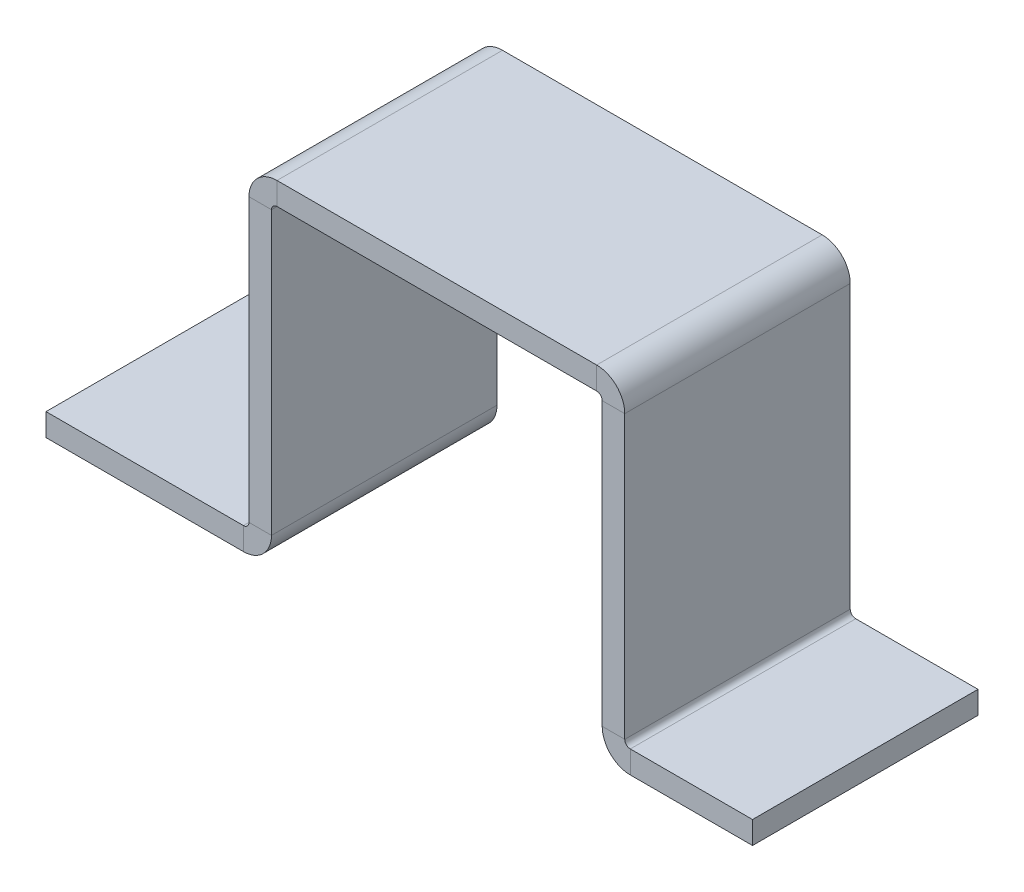
ISO-10303-21;
HEADER;
FILE_DESCRIPTION(('STEP AP214'),'2;1');
FILE_NAME('part.step','',(''),(''),'','','');
FILE_SCHEMA(('AUTOMOTIVE_DESIGN { 1 0 10303 214 1 1 1 1 }'));
ENDSEC;
DATA;
#1=APPLICATION_CONTEXT('core data for automotive mechanical design processes');
#2=APPLICATION_PROTOCOL_DEFINITION('international standard','automotive_design',2000,#1);
#3=PRODUCT_CONTEXT('',#1,'mechanical');
#4=PRODUCT('Part','Part','',(#3));
#5=PRODUCT_RELATED_PRODUCT_CATEGORY('part','',(#4));
#6=PRODUCT_DEFINITION_FORMATION('','',#4);
#7=PRODUCT_DEFINITION_CONTEXT('part definition',#1,'design');
#8=PRODUCT_DEFINITION('design','',#6,#7);
#9=PRODUCT_DEFINITION_SHAPE('','',#8);
#10=(LENGTH_UNIT() NAMED_UNIT(*) SI_UNIT(.MILLI.,.METRE.));
#11=(NAMED_UNIT(*) PLANE_ANGLE_UNIT() SI_UNIT($,.RADIAN.));
#12=(NAMED_UNIT(*) SI_UNIT($,.STERADIAN.) SOLID_ANGLE_UNIT());
#13=UNCERTAINTY_MEASURE_WITH_UNIT(LENGTH_MEASURE(1.E-05),#10,'distance_accuracy_value','');
#14=(GEOMETRIC_REPRESENTATION_CONTEXT(3) GLOBAL_UNCERTAINTY_ASSIGNED_CONTEXT((#13)) GLOBAL_UNIT_ASSIGNED_CONTEXT((#10,
#11,#12)) REPRESENTATION_CONTEXT('',''));
#15=CARTESIAN_POINT('',(0.,0.,0.));
#16=DIRECTION('',(0.,0.,1.));
#17=DIRECTION('',(1.,0.,0.));
#18=AXIS2_PLACEMENT_3D('',#15,#16,#17);
#19=CARTESIAN_POINT('',(27.,3.7366,30.));
#20=DIRECTION('',(0.,0.,1.));
#21=DIRECTION('',(1.,0.,0.));
#22=AXIS2_PLACEMENT_3D('',#19,#20,#21);
#23=PLANE('',#22);
#24=DIRECTION('',(1.,0.,0.));
#25=VECTOR('',#24,1.);
#26=CARTESIAN_POINT('',(27.,3.7366,30.));
#27=LINE('',#26,#25);
#28=CARTESIAN_POINT('',(27.,3.7366,30.));
#29=VERTEX_POINT('',#28);
#30=CARTESIAN_POINT('',(30.,3.7366,30.));
#31=VERTEX_POINT('',#30);
#32=EDGE_CURVE('E11',#29,#31,#27,.T.);
#33=ORIENTED_EDGE('',*,*,#32,.F.);
#34=CARTESIAN_POINT('',(26.2634,3.7366,30.));
#35=DIRECTION('',(0.,0.,-1.));
#36=DIRECTION('',(-1.,0.,0.));
#37=AXIS2_PLACEMENT_3D('',#34,#35,#36);
#38=CIRCLE('',#37,0.7366);
#39=CARTESIAN_POINT('',(26.2634,3.,30.));
#40=VERTEX_POINT('',#39);
#41=EDGE_CURVE('E368',#40,#29,#38,.F.);
#42=ORIENTED_EDGE('',*,*,#41,.F.);
#43=DIRECTION('',(0.,1.,0.));
#44=VECTOR('',#43,1.);
#45=CARTESIAN_POINT('',(26.2634,0.,30.));
#46=LINE('',#45,#44);
#47=CARTESIAN_POINT('',(26.2634,0.,30.));
#48=VERTEX_POINT('',#47);
#49=EDGE_CURVE('E47',#48,#40,#46,.T.);
#50=ORIENTED_EDGE('',*,*,#49,.F.);
#51=CARTESIAN_POINT('',(26.2634,3.7366,30.));
#52=DIRECTION('',(0.,0.,1.));
#53=DIRECTION('',(1.,0.,0.));
#54=AXIS2_PLACEMENT_3D('',#51,#52,#53);
#55=CIRCLE('',#54,3.7366);
#56=EDGE_CURVE('E381',#48,#31,#55,.T.);
#57=ORIENTED_EDGE('',*,*,#56,.T.);
#58=EDGE_LOOP('',(#33,#42,#50,#57));
#59=FACE_BOUND('',#58,.T.);
#60=ADVANCED_FACE('F39',(#59),#23,.T.);
#61=CARTESIAN_POINT('',(26.2634,0.,30.));
#62=DIRECTION('',(0.,0.,1.));
#63=DIRECTION('',(1.,0.,0.));
#64=AXIS2_PLACEMENT_3D('',#61,#62,#63);
#65=PLANE('',#64);
#66=DIRECTION('',(0.,1.,0.));
#67=VECTOR('',#66,1.);
#68=CARTESIAN_POINT('',(27.,3.,30.));
#69=LINE('',#68,#67);
#70=CARTESIAN_POINT('',(27.,41.2634,30.));
#71=VERTEX_POINT('',#70);
#72=EDGE_CURVE('E372',#29,#71,#69,.T.);
#73=ORIENTED_EDGE('',*,*,#72,.F.);
#74=ORIENTED_EDGE('',*,*,#32,.T.);
#75=DIRECTION('',(0.,1.,0.));
#76=VECTOR('',#75,1.);
#77=CARTESIAN_POINT('',(30.,3.,30.));
#78=LINE('',#77,#76);
#79=CARTESIAN_POINT('',(30.,41.2634,30.));
#80=VERTEX_POINT('',#79);
#81=EDGE_CURVE('E383',#31,#80,#78,.T.);
#82=ORIENTED_EDGE('',*,*,#81,.T.);
#83=DIRECTION('',(-1.,0.,0.));
#84=VECTOR('',#83,1.);
#85=CARTESIAN_POINT('',(30.,41.2634,30.));
#86=LINE('',#85,#84);
#87=EDGE_CURVE('E342',#80,#71,#86,.T.);
#88=ORIENTED_EDGE('',*,*,#87,.T.);
#89=EDGE_LOOP('',(#73,#74,#82,#88));
#90=FACE_BOUND('',#89,.T.);
#91=ADVANCED_FACE('F452',(#90),#65,.T.);
#92=CARTESIAN_POINT('',(26.2634,3.,0.));
#93=DIRECTION('',(0.,0.,-1.));
#94=DIRECTION('',(-1.,0.,0.));
#95=AXIS2_PLACEMENT_3D('',#92,#93,#94);
#96=PLANE('',#95);
#97=DIRECTION('',(0.,-1.,0.));
#98=VECTOR('',#97,1.);
#99=CARTESIAN_POINT('',(26.2634,3.,0.));
#100=LINE('',#99,#98);
#101=CARTESIAN_POINT('',(26.2634,3.,0.));
#102=VERTEX_POINT('',#101);
#103=CARTESIAN_POINT('',(26.2634,0.,0.));
#104=VERTEX_POINT('',#103);
#105=EDGE_CURVE('E348',#102,#104,#100,.T.);
#106=ORIENTED_EDGE('',*,*,#105,.F.);
#107=CARTESIAN_POINT('',(26.2634,3.7366,0.));
#108=DIRECTION('',(0.,0.,-1.));
#109=DIRECTION('',(-1.,0.,0.));
#110=AXIS2_PLACEMENT_3D('',#107,#108,#109);
#111=CIRCLE('',#110,0.7366);
#112=CARTESIAN_POINT('',(27.,3.7366,0.));
#113=VERTEX_POINT('',#112);
#114=EDGE_CURVE('E252',#102,#113,#111,.F.);
#115=ORIENTED_EDGE('',*,*,#114,.T.);
#116=DIRECTION('',(-1.,0.,0.));
#117=VECTOR('',#116,1.);
#118=CARTESIAN_POINT('',(30.,3.7366,0.));
#119=LINE('',#118,#117);
#120=CARTESIAN_POINT('',(30.,3.7366,0.));
#121=VERTEX_POINT('',#120);
#122=EDGE_CURVE('E346',#121,#113,#119,.T.);
#123=ORIENTED_EDGE('',*,*,#122,.F.);
#124=CARTESIAN_POINT('',(26.2634,3.7366,0.));
#125=DIRECTION('',(0.,0.,1.));
#126=DIRECTION('',(1.,0.,0.));
#127=AXIS2_PLACEMENT_3D('',#124,#125,#126);
#128=CIRCLE('',#127,3.7366);
#129=EDGE_CURVE('E264',#104,#121,#128,.T.);
#130=ORIENTED_EDGE('',*,*,#129,.F.);
#131=EDGE_LOOP('',(#106,#115,#123,#130));
#132=FACE_BOUND('',#131,.T.);
#133=ADVANCED_FACE('F494',(#132),#96,.T.);
#134=CARTESIAN_POINT('',(30.,3.7366,0.));
#135=DIRECTION('',(0.,0.,-1.));
#136=DIRECTION('',(-1.,0.,0.));
#137=AXIS2_PLACEMENT_3D('',#134,#135,#136);
#138=PLANE('',#137);
#139=DIRECTION('',(1.,0.,0.));
#140=VECTOR('',#139,1.);
#141=CARTESIAN_POINT('',(0.,3.,0.));
#142=LINE('',#141,#140);
#143=CARTESIAN_POINT('',(0.,3.,0.));
#144=VERTEX_POINT('',#143);
#145=EDGE_CURVE('E255',#144,#102,#142,.T.);
#146=ORIENTED_EDGE('',*,*,#145,.T.);
#147=ORIENTED_EDGE('',*,*,#105,.T.);
#148=DIRECTION('',(1.,0.,0.));
#149=VECTOR('',#148,1.);
#150=CARTESIAN_POINT('',(0.,0.,0.));
#151=LINE('',#150,#149);
#152=CARTESIAN_POINT('',(0.,0.,0.));
#153=VERTEX_POINT('',#152);
#154=EDGE_CURVE('E261',#153,#104,#151,.T.);
#155=ORIENTED_EDGE('',*,*,#154,.F.);
#156=DIRECTION('',(0.,1.,0.));
#157=VECTOR('',#156,1.);
#158=CARTESIAN_POINT('',(0.,0.,0.));
#159=LINE('',#158,#157);
#160=EDGE_CURVE('E258',#153,#144,#159,.T.);
#161=ORIENTED_EDGE('',*,*,#160,.T.);
#162=EDGE_LOOP('',(#146,#147,#155,#161));
#163=FACE_BOUND('',#162,.T.);
#164=ADVANCED_FACE('F498',(#163),#138,.T.);
#165=CARTESIAN_POINT('',(30.7366,45.,30.));
#166=DIRECTION('',(0.,0.,1.));
#167=DIRECTION('',(1.,0.,0.));
#168=AXIS2_PLACEMENT_3D('',#165,#166,#167);
#169=PLANE('',#168);
#170=DIRECTION('',(0.,-1.,0.));
#171=VECTOR('',#170,1.);
#172=CARTESIAN_POINT('',(30.7366,45.,30.));
#173=LINE('',#172,#171);
#174=CARTESIAN_POINT('',(30.7366,45.,30.));
#175=VERTEX_POINT('',#174);
#176=CARTESIAN_POINT('',(30.7366,42.,30.));
#177=VERTEX_POINT('',#176);
#178=EDGE_CURVE('E344',#175,#177,#173,.T.);
#179=ORIENTED_EDGE('',*,*,#178,.F.);
#180=CARTESIAN_POINT('',(30.7366,41.2634,30.));
#181=DIRECTION('',(0.,0.,1.));
#182=DIRECTION('',(1.,0.,0.));
#183=AXIS2_PLACEMENT_3D('',#180,#181,#182);
#184=CIRCLE('',#183,3.7366);
#185=EDGE_CURVE('E442',#71,#175,#184,.F.);
#186=ORIENTED_EDGE('',*,*,#185,.F.);
#187=ORIENTED_EDGE('',*,*,#87,.F.);
#188=CARTESIAN_POINT('',(30.7366,41.2634,30.));
#189=DIRECTION('',(0.,0.,1.));
#190=DIRECTION('',(1.,0.,0.));
#191=AXIS2_PLACEMENT_3D('',#188,#189,#190);
#192=CIRCLE('',#191,0.7366);
#193=EDGE_CURVE('E386',#80,#177,#192,.F.);
#194=ORIENTED_EDGE('',*,*,#193,.T.);
#195=EDGE_LOOP('',(#179,#186,#187,#194));
#196=FACE_BOUND('',#195,.T.);
#197=ADVANCED_FACE('F459',(#196),#169,.T.);
#198=CARTESIAN_POINT('',(30.,41.2634,30.));
#199=DIRECTION('',(0.,0.,1.));
#200=DIRECTION('',(1.,0.,0.));
#201=AXIS2_PLACEMENT_3D('',#198,#199,#200);
#202=PLANE('',#201);
#203=DIRECTION('',(1.,0.,0.));
#204=VECTOR('',#203,1.);
#205=CARTESIAN_POINT('',(27.,45.,30.));
#206=LINE('',#205,#204);
#207=CARTESIAN_POINT('',(73.2634,45.,30.));
#208=VERTEX_POINT('',#207);
#209=EDGE_CURVE('E439',#175,#208,#206,.T.);
#210=ORIENTED_EDGE('',*,*,#209,.F.);
#211=ORIENTED_EDGE('',*,*,#178,.T.);
#212=DIRECTION('',(1.,0.,0.));
#213=VECTOR('',#212,1.);
#214=CARTESIAN_POINT('',(27.,42.,30.));
#215=LINE('',#214,#213);
#216=CARTESIAN_POINT('',(73.2634,42.,30.));
#217=VERTEX_POINT('',#216);
#218=EDGE_CURVE('E206',#177,#217,#215,.T.);
#219=ORIENTED_EDGE('',*,*,#218,.T.);
#220=DIRECTION('',(0.,1.,0.));
#221=VECTOR('',#220,1.);
#222=CARTESIAN_POINT('',(73.2634,42.,30.));
#223=LINE('',#222,#221);
#224=EDGE_CURVE('E197',#217,#208,#223,.T.);
#225=ORIENTED_EDGE('',*,*,#224,.T.);
#226=EDGE_LOOP('',(#210,#211,#219,#225));
#227=FACE_BOUND('',#226,.T.);
#228=ADVANCED_FACE('F392',(#227),#202,.T.);
#229=CARTESIAN_POINT('',(27.,41.2634,0.));
#230=DIRECTION('',(0.,0.,-1.));
#231=DIRECTION('',(-1.,0.,0.));
#232=AXIS2_PLACEMENT_3D('',#229,#230,#231);
#233=PLANE('',#232);
#234=DIRECTION('',(1.,0.,0.));
#235=VECTOR('',#234,1.);
#236=CARTESIAN_POINT('',(27.,41.2634,0.));
#237=LINE('',#236,#235);
#238=CARTESIAN_POINT('',(27.,41.2634,0.));
#239=VERTEX_POINT('',#238);
#240=CARTESIAN_POINT('',(30.,41.2634,0.));
#241=VERTEX_POINT('',#240);
#242=EDGE_CURVE('E340',#239,#241,#237,.T.);
#243=ORIENTED_EDGE('',*,*,#242,.F.);
#244=CARTESIAN_POINT('',(30.7366,41.2634,0.));
#245=DIRECTION('',(0.,0.,1.));
#246=DIRECTION('',(1.,0.,0.));
#247=AXIS2_PLACEMENT_3D('',#244,#245,#246);
#248=CIRCLE('',#247,3.7366);
#249=CARTESIAN_POINT('',(30.7366,45.,0.));
#250=VERTEX_POINT('',#249);
#251=EDGE_CURVE('E246',#239,#250,#248,.F.);
#252=ORIENTED_EDGE('',*,*,#251,.T.);
#253=DIRECTION('',(0.,1.,0.));
#254=VECTOR('',#253,1.);
#255=CARTESIAN_POINT('',(30.7366,42.,0.));
#256=LINE('',#255,#254);
#257=CARTESIAN_POINT('',(30.7366,42.,0.));
#258=VERTEX_POINT('',#257);
#259=EDGE_CURVE('E196',#258,#250,#256,.T.);
#260=ORIENTED_EDGE('',*,*,#259,.F.);
#261=CARTESIAN_POINT('',(30.7366,41.2634,0.));
#262=DIRECTION('',(0.,0.,1.));
#263=DIRECTION('',(1.,0.,0.));
#264=AXIS2_PLACEMENT_3D('',#261,#262,#263);
#265=CIRCLE('',#264,0.7366);
#266=EDGE_CURVE('E270',#241,#258,#265,.F.);
#267=ORIENTED_EDGE('',*,*,#266,.F.);
#268=EDGE_LOOP('',(#243,#252,#260,#267));
#269=FACE_BOUND('',#268,.T.);
#270=ADVANCED_FACE('F468',(#269),#233,.T.);
#271=CARTESIAN_POINT('',(30.7366,42.,0.));
#272=DIRECTION('',(0.,0.,-1.));
#273=DIRECTION('',(-1.,0.,0.));
#274=AXIS2_PLACEMENT_3D('',#271,#272,#273);
#275=PLANE('',#274);
#276=DIRECTION('',(0.,1.,0.));
#277=VECTOR('',#276,1.);
#278=CARTESIAN_POINT('',(27.,3.,0.));
#279=LINE('',#278,#277);
#280=EDGE_CURVE('E249',#113,#239,#279,.T.);
#281=ORIENTED_EDGE('',*,*,#280,.T.);
#282=ORIENTED_EDGE('',*,*,#242,.T.);
#283=DIRECTION('',(0.,1.,0.));
#284=VECTOR('',#283,1.);
#285=CARTESIAN_POINT('',(30.,3.,0.));
#286=LINE('',#285,#284);
#287=EDGE_CURVE('E267',#121,#241,#286,.T.);
#288=ORIENTED_EDGE('',*,*,#287,.F.);
#289=ORIENTED_EDGE('',*,*,#122,.T.);
#290=EDGE_LOOP('',(#281,#282,#288,#289));
#291=FACE_BOUND('',#290,.T.);
#292=ADVANCED_FACE('F472',(#291),#275,.T.);
#293=CARTESIAN_POINT('',(77.,41.2634,30.));
#294=DIRECTION('',(0.,0.,1.));
#295=DIRECTION('',(1.,0.,0.));
#296=AXIS2_PLACEMENT_3D('',#293,#294,#295);
#297=PLANE('',#296);
#298=DIRECTION('',(-1.,0.,0.));
#299=VECTOR('',#298,1.);
#300=CARTESIAN_POINT('',(77.,41.2634,30.));
#301=LINE('',#300,#299);
#302=CARTESIAN_POINT('',(77.,41.2634,30.));
#303=VERTEX_POINT('',#302);
#304=CARTESIAN_POINT('',(74.,41.2634,30.));
#305=VERTEX_POINT('',#304);
#306=EDGE_CURVE('E184',#303,#305,#301,.T.);
#307=ORIENTED_EDGE('',*,*,#306,.F.);
#308=CARTESIAN_POINT('',(73.2634,41.2634,30.));
#309=DIRECTION('',(0.,0.,1.));
#310=DIRECTION('',(1.,0.,0.));
#311=AXIS2_PLACEMENT_3D('',#308,#309,#310);
#312=CIRCLE('',#311,3.7366);
#313=EDGE_CURVE('E404',#208,#303,#312,.F.);
#314=ORIENTED_EDGE('',*,*,#313,.F.);
#315=ORIENTED_EDGE('',*,*,#224,.F.);
#316=CARTESIAN_POINT('',(73.2634,41.2634,30.));
#317=DIRECTION('',(0.,0.,1.));
#318=DIRECTION('',(1.,0.,0.));
#319=AXIS2_PLACEMENT_3D('',#316,#317,#318);
#320=CIRCLE('',#319,0.7366);
#321=EDGE_CURVE('E200',#217,#305,#320,.F.);
#322=ORIENTED_EDGE('',*,*,#321,.T.);
#323=EDGE_LOOP('',(#307,#314,#315,#322));
#324=FACE_BOUND('',#323,.T.);
#325=ADVANCED_FACE('F202',(#324),#297,.T.);
#326=CARTESIAN_POINT('',(73.2634,42.,30.));
#327=DIRECTION('',(0.,0.,1.));
#328=DIRECTION('',(1.,0.,0.));
#329=AXIS2_PLACEMENT_3D('',#326,#327,#328);
#330=PLANE('',#329);
#331=DIRECTION('',(0.,-1.,0.));
#332=VECTOR('',#331,1.);
#333=CARTESIAN_POINT('',(77.,45.,30.));
#334=LINE('',#333,#332);
#335=CARTESIAN_POINT('',(77.,3.7366,30.));
#336=VERTEX_POINT('',#335);
#337=EDGE_CURVE('E191',#303,#336,#334,.T.);
#338=ORIENTED_EDGE('',*,*,#337,.F.);
#339=ORIENTED_EDGE('',*,*,#306,.T.);
#340=DIRECTION('',(0.,1.,0.));
#341=VECTOR('',#340,1.);
#342=CARTESIAN_POINT('',(74.,45.,30.));
#343=LINE('',#342,#341);
#344=CARTESIAN_POINT('',(74.,3.7366,30.));
#345=VERTEX_POINT('',#344);
#346=EDGE_CURVE('E188',#305,#345,#343,.F.);
#347=ORIENTED_EDGE('',*,*,#346,.T.);
#348=DIRECTION('',(1.,0.,0.));
#349=VECTOR('',#348,1.);
#350=CARTESIAN_POINT('',(74.,3.7366,30.));
#351=LINE('',#350,#349);
#352=EDGE_CURVE('E331',#345,#336,#351,.T.);
#353=ORIENTED_EDGE('',*,*,#352,.T.);
#354=EDGE_LOOP('',(#338,#339,#347,#353));
#355=FACE_BOUND('',#354,.T.);
#356=ADVANCED_FACE('F186',(#355),#330,.T.);
#357=CARTESIAN_POINT('',(73.2634,45.,0.));
#358=DIRECTION('',(0.,0.,-1.));
#359=DIRECTION('',(-1.,0.,0.));
#360=AXIS2_PLACEMENT_3D('',#357,#358,#359);
#361=PLANE('',#360);
#362=DIRECTION('',(0.,-1.,0.));
#363=VECTOR('',#362,1.);
#364=CARTESIAN_POINT('',(73.2634,45.,0.));
#365=LINE('',#364,#363);
#366=CARTESIAN_POINT('',(73.2634,45.,0.));
#367=VERTEX_POINT('',#366);
#368=CARTESIAN_POINT('',(73.2634,42.,0.));
#369=VERTEX_POINT('',#368);
#370=EDGE_CURVE('E336',#367,#369,#365,.T.);
#371=ORIENTED_EDGE('',*,*,#370,.F.);
#372=CARTESIAN_POINT('',(73.2634,41.2634,0.));
#373=DIRECTION('',(0.,0.,1.));
#374=DIRECTION('',(1.,0.,0.));
#375=AXIS2_PLACEMENT_3D('',#372,#373,#374);
#376=CIRCLE('',#375,3.7366);
#377=CARTESIAN_POINT('',(77.,41.2634,0.));
#378=VERTEX_POINT('',#377);
#379=EDGE_CURVE('E240',#367,#378,#376,.F.);
#380=ORIENTED_EDGE('',*,*,#379,.T.);
#381=DIRECTION('',(1.,0.,0.));
#382=VECTOR('',#381,1.);
#383=CARTESIAN_POINT('',(74.,41.2634,0.));
#384=LINE('',#383,#382);
#385=CARTESIAN_POINT('',(74.,41.2634,0.));
#386=VERTEX_POINT('',#385);
#387=EDGE_CURVE('E334',#386,#378,#384,.T.);
#388=ORIENTED_EDGE('',*,*,#387,.F.);
#389=CARTESIAN_POINT('',(73.2634,41.2634,0.));
#390=DIRECTION('',(0.,0.,1.));
#391=DIRECTION('',(1.,0.,0.));
#392=AXIS2_PLACEMENT_3D('',#389,#390,#391);
#393=CIRCLE('',#392,0.7366);
#394=EDGE_CURVE('E213',#369,#386,#393,.F.);
#395=ORIENTED_EDGE('',*,*,#394,.F.);
#396=EDGE_LOOP('',(#371,#380,#388,#395));
#397=FACE_BOUND('',#396,.T.);
#398=ADVANCED_FACE('F398',(#397),#361,.T.);
#399=CARTESIAN_POINT('',(74.,41.2634,0.));
#400=DIRECTION('',(0.,0.,-1.));
#401=DIRECTION('',(-1.,0.,0.));
#402=AXIS2_PLACEMENT_3D('',#399,#400,#401);
#403=PLANE('',#402);
#404=DIRECTION('',(1.,0.,0.));
#405=VECTOR('',#404,1.);
#406=CARTESIAN_POINT('',(27.,45.,0.));
#407=LINE('',#406,#405);
#408=EDGE_CURVE('E243',#250,#367,#407,.T.);
#409=ORIENTED_EDGE('',*,*,#408,.T.);
#410=ORIENTED_EDGE('',*,*,#370,.T.);
#411=DIRECTION('',(1.,0.,0.));
#412=VECTOR('',#411,1.);
#413=CARTESIAN_POINT('',(27.,42.,0.));
#414=LINE('',#413,#412);
#415=EDGE_CURVE('E273',#258,#369,#414,.T.);
#416=ORIENTED_EDGE('',*,*,#415,.F.);
#417=ORIENTED_EDGE('',*,*,#259,.T.);
#418=EDGE_LOOP('',(#409,#410,#416,#417));
#419=FACE_BOUND('',#418,.T.);
#420=ADVANCED_FACE('F478',(#419),#403,.T.);
#421=CARTESIAN_POINT('',(77.7366,3.,30.));
#422=DIRECTION('',(0.,0.,1.));
#423=DIRECTION('',(1.,0.,0.));
#424=AXIS2_PLACEMENT_3D('',#421,#422,#423);
#425=PLANE('',#424);
#426=DIRECTION('',(0.,-1.,0.));
#427=VECTOR('',#426,1.);
#428=CARTESIAN_POINT('',(77.7366,3.,30.));
#429=LINE('',#428,#427);
#430=CARTESIAN_POINT('',(77.7366,3.,30.));
#431=VERTEX_POINT('',#430);
#432=CARTESIAN_POINT('',(77.7366,0.,30.));
#433=VERTEX_POINT('',#432);
#434=EDGE_CURVE('E55',#431,#433,#429,.T.);
#435=ORIENTED_EDGE('',*,*,#434,.F.);
#436=CARTESIAN_POINT('',(77.7366,3.7366,30.));
#437=DIRECTION('',(0.,0.,-1.));
#438=DIRECTION('',(-1.,0.,0.));
#439=AXIS2_PLACEMENT_3D('',#436,#437,#438);
#440=CIRCLE('',#439,0.7366);
#441=EDGE_CURVE('E432',#336,#431,#440,.F.);
#442=ORIENTED_EDGE('',*,*,#441,.F.);
#443=ORIENTED_EDGE('',*,*,#352,.F.);
#444=CARTESIAN_POINT('',(77.7366,3.7366,30.));
#445=DIRECTION('',(0.,0.,1.));
#446=DIRECTION('',(1.,0.,0.));
#447=AXIS2_PLACEMENT_3D('',#444,#445,#446);
#448=CIRCLE('',#447,3.7366);
#449=EDGE_CURVE('E221',#345,#433,#448,.T.);
#450=ORIENTED_EDGE('',*,*,#449,.T.);
#451=EDGE_LOOP('',(#435,#442,#443,#450));
#452=FACE_BOUND('',#451,.T.);
#453=ADVANCED_FACE('F480',(#452),#425,.T.);
#454=CARTESIAN_POINT('',(74.,3.7366,30.));
#455=DIRECTION('',(0.,0.,1.));
#456=DIRECTION('',(1.,0.,0.));
#457=AXIS2_PLACEMENT_3D('',#454,#455,#456);
#458=PLANE('',#457);
#459=DIRECTION('',(1.,0.,0.));
#460=VECTOR('',#459,1.);
#461=CARTESIAN_POINT('',(77.,3.,30.));
#462=LINE('',#461,#460);
#463=CARTESIAN_POINT('',(94.,3.,30.));
#464=VERTEX_POINT('',#463);
#465=EDGE_CURVE('E430',#431,#464,#462,.T.);
#466=ORIENTED_EDGE('',*,*,#465,.F.);
#467=ORIENTED_EDGE('',*,*,#434,.T.);
#468=DIRECTION('',(1.,0.,0.));
#469=VECTOR('',#468,1.);
#470=CARTESIAN_POINT('',(77.,0.,30.));
#471=LINE('',#470,#469);
#472=CARTESIAN_POINT('',(94.,0.,30.));
#473=VERTEX_POINT('',#472);
#474=EDGE_CURVE('E133',#433,#473,#471,.T.);
#475=ORIENTED_EDGE('',*,*,#474,.T.);
#476=DIRECTION('',(0.,-1.,0.));
#477=VECTOR('',#476,1.);
#478=CARTESIAN_POINT('',(94.,3.,30.));
#479=LINE('',#478,#477);
#480=EDGE_CURVE('E428',#464,#473,#479,.T.);
#481=ORIENTED_EDGE('',*,*,#480,.F.);
#482=EDGE_LOOP('',(#466,#467,#475,#481));
#483=FACE_BOUND('',#482,.T.);
#484=ADVANCED_FACE('F486',(#483),#458,.T.);
#485=CARTESIAN_POINT('',(77.,3.7366,0.));
#486=DIRECTION('',(0.,0.,-1.));
#487=DIRECTION('',(-1.,0.,0.));
#488=AXIS2_PLACEMENT_3D('',#485,#486,#487);
#489=PLANE('',#488);
#490=DIRECTION('',(-1.,0.,0.));
#491=VECTOR('',#490,1.);
#492=CARTESIAN_POINT('',(77.,3.7366,0.));
#493=LINE('',#492,#491);
#494=CARTESIAN_POINT('',(77.,3.7366,0.));
#495=VERTEX_POINT('',#494);
#496=CARTESIAN_POINT('',(74.,3.7366,0.));
#497=VERTEX_POINT('',#496);
#498=EDGE_CURVE('E120',#495,#497,#493,.T.);
#499=ORIENTED_EDGE('',*,*,#498,.F.);
#500=CARTESIAN_POINT('',(77.7366,3.7366,0.));
#501=DIRECTION('',(0.,0.,-1.));
#502=DIRECTION('',(-1.,0.,0.));
#503=AXIS2_PLACEMENT_3D('',#500,#501,#502);
#504=CIRCLE('',#503,0.7366);
#505=CARTESIAN_POINT('',(77.7366,3.,0.));
#506=VERTEX_POINT('',#505);
#507=EDGE_CURVE('E236',#495,#506,#504,.F.);
#508=ORIENTED_EDGE('',*,*,#507,.T.);
#509=DIRECTION('',(0.,1.,0.));
#510=VECTOR('',#509,1.);
#511=CARTESIAN_POINT('',(77.7366,0.,0.));
#512=LINE('',#511,#510);
#513=CARTESIAN_POINT('',(77.7366,0.,0.));
#514=VERTEX_POINT('',#513);
#515=EDGE_CURVE('E127',#514,#506,#512,.T.);
#516=ORIENTED_EDGE('',*,*,#515,.F.);
#517=CARTESIAN_POINT('',(77.7366,3.7366,0.));
#518=DIRECTION('',(0.,0.,1.));
#519=DIRECTION('',(1.,0.,0.));
#520=AXIS2_PLACEMENT_3D('',#517,#518,#519);
#521=CIRCLE('',#520,3.7366);
#522=EDGE_CURVE('E279',#497,#514,#521,.T.);
#523=ORIENTED_EDGE('',*,*,#522,.F.);
#524=EDGE_LOOP('',(#499,#508,#516,#523));
#525=FACE_BOUND('',#524,.T.);
#526=ADVANCED_FACE('F415',(#525),#489,.T.);
#527=CARTESIAN_POINT('',(77.7366,0.,0.));
#528=DIRECTION('',(0.,0.,-1.));
#529=DIRECTION('',(-1.,0.,0.));
#530=AXIS2_PLACEMENT_3D('',#527,#528,#529);
#531=PLANE('',#530);
#532=DIRECTION('',(0.,-1.,0.));
#533=VECTOR('',#532,1.);
#534=CARTESIAN_POINT('',(77.,45.,0.));
#535=LINE('',#534,#533);
#536=EDGE_CURVE('E238',#378,#495,#535,.T.);
#537=ORIENTED_EDGE('',*,*,#536,.T.);
#538=ORIENTED_EDGE('',*,*,#498,.T.);
#539=DIRECTION('',(0.,1.,0.));
#540=VECTOR('',#539,1.);
#541=CARTESIAN_POINT('',(74.,45.,0.));
#542=LINE('',#541,#540);
#543=EDGE_CURVE('E277',#386,#497,#542,.F.);
#544=ORIENTED_EDGE('',*,*,#543,.F.);
#545=ORIENTED_EDGE('',*,*,#387,.T.);
#546=EDGE_LOOP('',(#537,#538,#544,#545));
#547=FACE_BOUND('',#546,.T.);
#548=ADVANCED_FACE('F400',(#547),#531,.T.);
#549=CARTESIAN_POINT('',(77.,0.,30.));
#550=DIRECTION('',(0.,1.,0.));
#551=DIRECTION('',(0.,0.,1.));
#552=AXIS2_PLACEMENT_3D('',#549,#550,#551);
#553=PLANE('',#552);
#554=DIRECTION('',(1.,0.,0.));
#555=VECTOR('',#554,1.);
#556=CARTESIAN_POINT('',(77.,0.,0.));
#557=LINE('',#556,#555);
#558=CARTESIAN_POINT('',(94.,0.,0.));
#559=VERTEX_POINT('',#558);
#560=EDGE_CURVE('E227',#514,#559,#557,.T.);
#561=ORIENTED_EDGE('',*,*,#560,.T.);
#562=DIRECTION('',(0.,0.,-1.));
#563=VECTOR('',#562,1.);
#564=CARTESIAN_POINT('',(94.,0.,30.));
#565=LINE('',#564,#563);
#566=EDGE_CURVE('E327',#473,#559,#565,.T.);
#567=ORIENTED_EDGE('',*,*,#566,.F.);
#568=ORIENTED_EDGE('',*,*,#474,.F.);
#569=DIRECTION('',(0.,0.,-1.));
#570=VECTOR('',#569,1.);
#571=CARTESIAN_POINT('',(77.7366,0.,30.));
#572=LINE('',#571,#570);
#573=EDGE_CURVE('E223',#433,#514,#572,.T.);
#574=ORIENTED_EDGE('',*,*,#573,.T.);
#575=EDGE_LOOP('',(#561,#567,#568,#574));
#576=FACE_BOUND('',#575,.T.);
#577=ADVANCED_FACE('F421',(#576),#553,.F.);
#578=CARTESIAN_POINT('',(94.,3.,30.));
#579=DIRECTION('',(1.,0.,0.));
#580=DIRECTION('',(0.,0.,-1.));
#581=AXIS2_PLACEMENT_3D('',#578,#579,#580);
#582=PLANE('',#581);
#583=DIRECTION('',(0.,-1.,0.));
#584=VECTOR('',#583,1.);
#585=CARTESIAN_POINT('',(94.,3.,0.));
#586=LINE('',#585,#584);
#587=CARTESIAN_POINT('',(94.,3.,0.));
#588=VERTEX_POINT('',#587);
#589=EDGE_CURVE('E230',#588,#559,#586,.T.);
#590=ORIENTED_EDGE('',*,*,#589,.F.);
#591=DIRECTION('',(0.,0.,-1.));
#592=VECTOR('',#591,1.);
#593=CARTESIAN_POINT('',(94.,3.,30.));
#594=LINE('',#593,#592);
#595=EDGE_CURVE('E325',#464,#588,#594,.T.);
#596=ORIENTED_EDGE('',*,*,#595,.F.);
#597=ORIENTED_EDGE('',*,*,#480,.T.);
#598=ORIENTED_EDGE('',*,*,#566,.T.);
#599=EDGE_LOOP('',(#590,#596,#597,#598));
#600=FACE_BOUND('',#599,.T.);
#601=ADVANCED_FACE('F426',(#600),#582,.T.);
#602=CARTESIAN_POINT('',(77.,3.,30.));
#603=DIRECTION('',(0.,1.,0.));
#604=DIRECTION('',(0.,0.,1.));
#605=AXIS2_PLACEMENT_3D('',#602,#603,#604);
#606=PLANE('',#605);
#607=DIRECTION('',(1.,0.,0.));
#608=VECTOR('',#607,1.);
#609=CARTESIAN_POINT('',(77.,3.,0.));
#610=LINE('',#609,#608);
#611=EDGE_CURVE('E233',#506,#588,#610,.T.);
#612=ORIENTED_EDGE('',*,*,#611,.F.);
#613=DIRECTION('',(0.,0.,-1.));
#614=VECTOR('',#613,1.);
#615=CARTESIAN_POINT('',(77.7366,3.,30.));
#616=LINE('',#615,#614);
#617=EDGE_CURVE('E322',#431,#506,#616,.T.);
#618=ORIENTED_EDGE('',*,*,#617,.F.);
#619=ORIENTED_EDGE('',*,*,#465,.T.);
#620=ORIENTED_EDGE('',*,*,#595,.T.);
#621=EDGE_LOOP('',(#612,#618,#619,#620));
#622=FACE_BOUND('',#621,.T.);
#623=ADVANCED_FACE('F582',(#622),#606,.T.);
#624=CARTESIAN_POINT('',(77.7366,3.7366,30.));
#625=DIRECTION('',(0.,0.,-1.));
#626=DIRECTION('',(-1.,0.,0.));
#627=AXIS2_PLACEMENT_3D('',#624,#625,#626);
#628=CYLINDRICAL_SURFACE('',#627,0.7366);
#629=ORIENTED_EDGE('',*,*,#507,.F.);
#630=DIRECTION('',(0.,0.,-1.));
#631=VECTOR('',#630,1.);
#632=CARTESIAN_POINT('',(77.,3.7366,30.));
#633=LINE('',#632,#631);
#634=EDGE_CURVE('E319',#336,#495,#633,.T.);
#635=ORIENTED_EDGE('',*,*,#634,.F.);
#636=ORIENTED_EDGE('',*,*,#441,.T.);
#637=ORIENTED_EDGE('',*,*,#617,.T.);
#638=EDGE_LOOP('',(#629,#635,#636,#637));
#639=FACE_BOUND('',#638,.T.);
#640=ADVANCED_FACE('F412',(#639),#628,.F.);
#641=CARTESIAN_POINT('',(77.,45.,30.));
#642=DIRECTION('',(1.,0.,0.));
#643=DIRECTION('',(0.,0.,-1.));
#644=AXIS2_PLACEMENT_3D('',#641,#642,#643);
#645=PLANE('',#644);
#646=ORIENTED_EDGE('',*,*,#536,.F.);
#647=DIRECTION('',(0.,0.,-1.));
#648=VECTOR('',#647,1.);
#649=CARTESIAN_POINT('',(77.,41.2634,30.));
#650=LINE('',#649,#648);
#651=EDGE_CURVE('E316',#303,#378,#650,.T.);
#652=ORIENTED_EDGE('',*,*,#651,.F.);
#653=ORIENTED_EDGE('',*,*,#337,.T.);
#654=ORIENTED_EDGE('',*,*,#634,.T.);
#655=EDGE_LOOP('',(#646,#652,#653,#654));
#656=FACE_BOUND('',#655,.T.);
#657=ADVANCED_FACE('F406',(#656),#645,.T.);
#658=CARTESIAN_POINT('',(73.2634,41.2634,30.));
#659=DIRECTION('',(0.,0.,-1.));
#660=DIRECTION('',(-1.,0.,0.));
#661=AXIS2_PLACEMENT_3D('',#658,#659,#660);
#662=CYLINDRICAL_SURFACE('',#661,3.7366);
#663=ORIENTED_EDGE('',*,*,#379,.F.);
#664=DIRECTION('',(0.,0.,-1.));
#665=VECTOR('',#664,1.);
#666=CARTESIAN_POINT('',(73.2634,45.,30.));
#667=LINE('',#666,#665);
#668=EDGE_CURVE('E313',#208,#367,#667,.T.);
#669=ORIENTED_EDGE('',*,*,#668,.F.);
#670=ORIENTED_EDGE('',*,*,#313,.T.);
#671=ORIENTED_EDGE('',*,*,#651,.T.);
#672=EDGE_LOOP('',(#663,#669,#670,#671));
#673=FACE_BOUND('',#672,.T.);
#674=ADVANCED_FACE('F403',(#673),#662,.T.);
#675=CARTESIAN_POINT('',(27.,45.,30.));
#676=DIRECTION('',(0.,1.,0.));
#677=DIRECTION('',(0.,0.,1.));
#678=AXIS2_PLACEMENT_3D('',#675,#676,#677);
#679=PLANE('',#678);
#680=ORIENTED_EDGE('',*,*,#408,.F.);
#681=DIRECTION('',(0.,0.,-1.));
#682=VECTOR('',#681,1.);
#683=CARTESIAN_POINT('',(30.7366,45.,30.));
#684=LINE('',#683,#682);
#685=EDGE_CURVE('E310',#175,#250,#684,.T.);
#686=ORIENTED_EDGE('',*,*,#685,.F.);
#687=ORIENTED_EDGE('',*,*,#209,.T.);
#688=ORIENTED_EDGE('',*,*,#668,.T.);
#689=EDGE_LOOP('',(#680,#686,#687,#688));
#690=FACE_BOUND('',#689,.T.);
#691=ADVANCED_FACE('F465',(#690),#679,.T.);
#692=CARTESIAN_POINT('',(30.7366,41.2634,30.));
#693=DIRECTION('',(0.,0.,-1.));
#694=DIRECTION('',(-1.,0.,0.));
#695=AXIS2_PLACEMENT_3D('',#692,#693,#694);
#696=CYLINDRICAL_SURFACE('',#695,3.7366);
#697=ORIENTED_EDGE('',*,*,#251,.F.);
#698=DIRECTION('',(0.,0.,-1.));
#699=VECTOR('',#698,1.);
#700=CARTESIAN_POINT('',(27.,41.2634,30.));
#701=LINE('',#700,#699);
#702=EDGE_CURVE('E307',#71,#239,#701,.T.);
#703=ORIENTED_EDGE('',*,*,#702,.F.);
#704=ORIENTED_EDGE('',*,*,#185,.T.);
#705=ORIENTED_EDGE('',*,*,#685,.T.);
#706=EDGE_LOOP('',(#697,#703,#704,#705));
#707=FACE_BOUND('',#706,.T.);
#708=ADVANCED_FACE('F458',(#707),#696,.T.);
#709=CARTESIAN_POINT('',(27.,3.,30.));
#710=DIRECTION('',(-1.,0.,0.));
#711=DIRECTION('',(0.,0.,1.));
#712=AXIS2_PLACEMENT_3D('',#709,#710,#711);
#713=PLANE('',#712);
#714=ORIENTED_EDGE('',*,*,#280,.F.);
#715=DIRECTION('',(0.,0.,-1.));
#716=VECTOR('',#715,1.);
#717=CARTESIAN_POINT('',(27.,3.7366,30.));
#718=LINE('',#717,#716);
#719=EDGE_CURVE('E304',#29,#113,#718,.T.);
#720=ORIENTED_EDGE('',*,*,#719,.F.);
#721=ORIENTED_EDGE('',*,*,#72,.T.);
#722=ORIENTED_EDGE('',*,*,#702,.T.);
#723=EDGE_LOOP('',(#714,#720,#721,#722));
#724=FACE_BOUND('',#723,.T.);
#725=ADVANCED_FACE('F448',(#724),#713,.T.);
#726=CARTESIAN_POINT('',(26.2634,3.7366,30.));
#727=DIRECTION('',(0.,0.,-1.));
#728=DIRECTION('',(-1.,0.,0.));
#729=AXIS2_PLACEMENT_3D('',#726,#727,#728);
#730=CYLINDRICAL_SURFACE('',#729,0.7366);
#731=ORIENTED_EDGE('',*,*,#114,.F.);
#732=DIRECTION('',(0.,0.,-1.));
#733=VECTOR('',#732,1.);
#734=CARTESIAN_POINT('',(26.2634,3.,30.));
#735=LINE('',#734,#733);
#736=EDGE_CURVE('E301',#40,#102,#735,.T.);
#737=ORIENTED_EDGE('',*,*,#736,.F.);
#738=ORIENTED_EDGE('',*,*,#41,.T.);
#739=ORIENTED_EDGE('',*,*,#719,.T.);
#740=EDGE_LOOP('',(#731,#737,#738,#739));
#741=FACE_BOUND('',#740,.T.);
#742=ADVANCED_FACE('F367',(#741),#730,.F.);
#743=CARTESIAN_POINT('',(0.,3.,30.));
#744=DIRECTION('',(0.,1.,0.));
#745=DIRECTION('',(0.,0.,1.));
#746=AXIS2_PLACEMENT_3D('',#743,#744,#745);
#747=PLANE('',#746);
#748=ORIENTED_EDGE('',*,*,#145,.F.);
#749=DIRECTION('',(0.,0.,-1.));
#750=VECTOR('',#749,1.);
#751=CARTESIAN_POINT('',(0.,3.,30.));
#752=LINE('',#751,#750);
#753=CARTESIAN_POINT('',(0.,3.,30.));
#754=VERTEX_POINT('',#753);
#755=EDGE_CURVE('E299',#754,#144,#752,.T.);
#756=ORIENTED_EDGE('',*,*,#755,.F.);
#757=DIRECTION('',(1.,0.,0.));
#758=VECTOR('',#757,1.);
#759=CARTESIAN_POINT('',(0.,3.,30.));
#760=LINE('',#759,#758);
#761=EDGE_CURVE('E356',#754,#40,#760,.T.);
#762=ORIENTED_EDGE('',*,*,#761,.T.);
#763=ORIENTED_EDGE('',*,*,#736,.T.);
#764=EDGE_LOOP('',(#748,#756,#762,#763));
#765=FACE_BOUND('',#764,.T.);
#766=ADVANCED_FACE('F374',(#765),#747,.T.);
#767=CARTESIAN_POINT('',(0.,0.,30.));
#768=DIRECTION('',(-1.,0.,0.));
#769=DIRECTION('',(0.,0.,1.));
#770=AXIS2_PLACEMENT_3D('',#767,#768,#769);
#771=PLANE('',#770);
#772=ORIENTED_EDGE('',*,*,#160,.F.);
#773=DIRECTION('',(0.,0.,-1.));
#774=VECTOR('',#773,1.);
#775=CARTESIAN_POINT('',(0.,0.,30.));
#776=LINE('',#775,#774);
#777=CARTESIAN_POINT('',(0.,0.,30.));
#778=VERTEX_POINT('',#777);
#779=EDGE_CURVE('E297',#778,#153,#776,.T.);
#780=ORIENTED_EDGE('',*,*,#779,.F.);
#781=DIRECTION('',(0.,1.,0.));
#782=VECTOR('',#781,1.);
#783=CARTESIAN_POINT('',(0.,0.,30.));
#784=LINE('',#783,#782);
#785=EDGE_CURVE('E375',#778,#754,#784,.T.);
#786=ORIENTED_EDGE('',*,*,#785,.T.);
#787=ORIENTED_EDGE('',*,*,#755,.T.);
#788=EDGE_LOOP('',(#772,#780,#786,#787));
#789=FACE_BOUND('',#788,.T.);
#790=ADVANCED_FACE('F665',(#789),#771,.T.);
#791=CARTESIAN_POINT('',(0.,0.,30.));
#792=DIRECTION('',(0.,1.,0.));
#793=DIRECTION('',(0.,0.,1.));
#794=AXIS2_PLACEMENT_3D('',#791,#792,#793);
#795=PLANE('',#794);
#796=ORIENTED_EDGE('',*,*,#154,.T.);
#797=DIRECTION('',(0.,0.,-1.));
#798=VECTOR('',#797,1.);
#799=CARTESIAN_POINT('',(26.2634,0.,30.));
#800=LINE('',#799,#798);
#801=EDGE_CURVE('E294',#48,#104,#800,.T.);
#802=ORIENTED_EDGE('',*,*,#801,.F.);
#803=DIRECTION('',(1.,0.,0.));
#804=VECTOR('',#803,1.);
#805=CARTESIAN_POINT('',(0.,0.,30.));
#806=LINE('',#805,#804);
#807=EDGE_CURVE('E359',#778,#48,#806,.T.);
#808=ORIENTED_EDGE('',*,*,#807,.F.);
#809=ORIENTED_EDGE('',*,*,#779,.T.);
#810=EDGE_LOOP('',(#796,#802,#808,#809));
#811=FACE_BOUND('',#810,.T.);
#812=ADVANCED_FACE('F675',(#811),#795,.F.);
#813=CARTESIAN_POINT('',(26.2634,3.7366,30.));
#814=DIRECTION('',(0.,0.,-1.));
#815=DIRECTION('',(-1.,0.,0.));
#816=AXIS2_PLACEMENT_3D('',#813,#814,#815);
#817=CYLINDRICAL_SURFACE('',#816,3.7366);
#818=ORIENTED_EDGE('',*,*,#129,.T.);
#819=DIRECTION('',(0.,0.,-1.));
#820=VECTOR('',#819,1.);
#821=CARTESIAN_POINT('',(30.,3.7366,30.));
#822=LINE('',#821,#820);
#823=EDGE_CURVE('E291',#31,#121,#822,.T.);
#824=ORIENTED_EDGE('',*,*,#823,.F.);
#825=ORIENTED_EDGE('',*,*,#56,.F.);
#826=ORIENTED_EDGE('',*,*,#801,.T.);
#827=EDGE_LOOP('',(#818,#824,#825,#826));
#828=FACE_BOUND('',#827,.T.);
#829=ADVANCED_FACE('F686',(#828),#817,.T.);
#830=CARTESIAN_POINT('',(30.,3.,30.));
#831=DIRECTION('',(-1.,0.,0.));
#832=DIRECTION('',(0.,0.,1.));
#833=AXIS2_PLACEMENT_3D('',#830,#831,#832);
#834=PLANE('',#833);
#835=ORIENTED_EDGE('',*,*,#287,.T.);
#836=DIRECTION('',(0.,0.,-1.));
#837=VECTOR('',#836,1.);
#838=CARTESIAN_POINT('',(30.,41.2634,30.));
#839=LINE('',#838,#837);
#840=EDGE_CURVE('E288',#80,#241,#839,.T.);
#841=ORIENTED_EDGE('',*,*,#840,.F.);
#842=ORIENTED_EDGE('',*,*,#81,.F.);
#843=ORIENTED_EDGE('',*,*,#823,.T.);
#844=EDGE_LOOP('',(#835,#841,#842,#843));
#845=FACE_BOUND('',#844,.T.);
#846=ADVANCED_FACE('F474',(#845),#834,.F.);
#847=CARTESIAN_POINT('',(30.7366,41.2634,30.));
#848=DIRECTION('',(0.,0.,-1.));
#849=DIRECTION('',(-1.,0.,0.));
#850=AXIS2_PLACEMENT_3D('',#847,#848,#849);
#851=CYLINDRICAL_SURFACE('',#850,0.7366);
#852=ORIENTED_EDGE('',*,*,#266,.T.);
#853=DIRECTION('',(0.,0.,-1.));
#854=VECTOR('',#853,1.);
#855=CARTESIAN_POINT('',(30.7366,42.,30.));
#856=LINE('',#855,#854);
#857=EDGE_CURVE('E285',#177,#258,#856,.T.);
#858=ORIENTED_EDGE('',*,*,#857,.F.);
#859=ORIENTED_EDGE('',*,*,#193,.F.);
#860=ORIENTED_EDGE('',*,*,#840,.T.);
#861=EDGE_LOOP('',(#852,#858,#859,#860));
#862=FACE_BOUND('',#861,.T.);
#863=ADVANCED_FACE('F477',(#862),#851,.F.);
#864=CARTESIAN_POINT('',(27.,42.,30.));
#865=DIRECTION('',(0.,1.,0.));
#866=DIRECTION('',(0.,0.,1.));
#867=AXIS2_PLACEMENT_3D('',#864,#865,#866);
#868=PLANE('',#867);
#869=ORIENTED_EDGE('',*,*,#415,.T.);
#870=DIRECTION('',(0.,0.,-1.));
#871=VECTOR('',#870,1.);
#872=CARTESIAN_POINT('',(73.2634,42.,30.));
#873=LINE('',#872,#871);
#874=EDGE_CURVE('E215',#217,#369,#873,.T.);
#875=ORIENTED_EDGE('',*,*,#874,.F.);
#876=ORIENTED_EDGE('',*,*,#218,.F.);
#877=ORIENTED_EDGE('',*,*,#857,.T.);
#878=EDGE_LOOP('',(#869,#875,#876,#877));
#879=FACE_BOUND('',#878,.T.);
#880=ADVANCED_FACE('F395',(#879),#868,.F.);
#881=CARTESIAN_POINT('',(73.2634,41.2634,30.));
#882=DIRECTION('',(0.,0.,-1.));
#883=DIRECTION('',(-1.,0.,0.));
#884=AXIS2_PLACEMENT_3D('',#881,#882,#883);
#885=CYLINDRICAL_SURFACE('',#884,0.7366);
#886=ORIENTED_EDGE('',*,*,#394,.T.);
#887=DIRECTION('',(0.,0.,-1.));
#888=VECTOR('',#887,1.);
#889=CARTESIAN_POINT('',(74.,41.2634,30.));
#890=LINE('',#889,#888);
#891=EDGE_CURVE('E210',#305,#386,#890,.T.);
#892=ORIENTED_EDGE('',*,*,#891,.F.);
#893=ORIENTED_EDGE('',*,*,#321,.F.);
#894=ORIENTED_EDGE('',*,*,#874,.T.);
#895=EDGE_LOOP('',(#886,#892,#893,#894));
#896=FACE_BOUND('',#895,.T.);
#897=ADVANCED_FACE('F211',(#896),#885,.F.);
#898=CARTESIAN_POINT('',(74.,45.,30.));
#899=DIRECTION('',(1.,0.,0.));
#900=DIRECTION('',(0.,0.,-1.));
#901=AXIS2_PLACEMENT_3D('',#898,#899,#900);
#902=PLANE('',#901);
#903=ORIENTED_EDGE('',*,*,#543,.T.);
#904=DIRECTION('',(0.,0.,-1.));
#905=VECTOR('',#904,1.);
#906=CARTESIAN_POINT('',(74.,3.7366,30.));
#907=LINE('',#906,#905);
#908=EDGE_CURVE('E216',#345,#497,#907,.T.);
#909=ORIENTED_EDGE('',*,*,#908,.F.);
#910=ORIENTED_EDGE('',*,*,#346,.F.);
#911=ORIENTED_EDGE('',*,*,#891,.T.);
#912=EDGE_LOOP('',(#903,#909,#910,#911));
#913=FACE_BOUND('',#912,.T.);
#914=ADVANCED_FACE('F218',(#913),#902,.F.);
#915=CARTESIAN_POINT('',(77.7366,3.7366,30.));
#916=DIRECTION('',(0.,0.,-1.));
#917=DIRECTION('',(-1.,0.,0.));
#918=AXIS2_PLACEMENT_3D('',#915,#916,#917);
#919=CYLINDRICAL_SURFACE('',#918,3.7366);
#920=ORIENTED_EDGE('',*,*,#522,.T.);
#921=ORIENTED_EDGE('',*,*,#573,.F.);
#922=ORIENTED_EDGE('',*,*,#449,.F.);
#923=ORIENTED_EDGE('',*,*,#908,.T.);
#924=EDGE_LOOP('',(#920,#921,#922,#923));
#925=FACE_BOUND('',#924,.T.);
#926=ADVANCED_FACE('F418',(#925),#919,.T.);
#927=CARTESIAN_POINT('',(77.7366,3.7366,30.));
#928=DIRECTION('',(0.,0.,-1.));
#929=DIRECTION('',(-1.,0.,0.));
#930=AXIS2_PLACEMENT_3D('',#927,#928,#929);
#931=PLANE('',#930);
#932=ORIENTED_EDGE('',*,*,#807,.T.);
#933=ORIENTED_EDGE('',*,*,#49,.T.);
#934=ORIENTED_EDGE('',*,*,#761,.F.);
#935=ORIENTED_EDGE('',*,*,#785,.F.);
#936=EDGE_LOOP('',(#932,#933,#934,#935));
#937=FACE_BOUND('',#936,.T.);
#938=ADVANCED_FACE('F353',(#937),#931,.F.);
#939=CARTESIAN_POINT('',(77.7366,3.7366,0.));
#940=DIRECTION('',(0.,0.,-1.));
#941=DIRECTION('',(-1.,0.,0.));
#942=AXIS2_PLACEMENT_3D('',#939,#940,#941);
#943=PLANE('',#942);
#944=ORIENTED_EDGE('',*,*,#560,.F.);
#945=ORIENTED_EDGE('',*,*,#515,.T.);
#946=ORIENTED_EDGE('',*,*,#611,.T.);
#947=ORIENTED_EDGE('',*,*,#589,.T.);
#948=EDGE_LOOP('',(#944,#945,#946,#947));
#949=FACE_BOUND('',#948,.T.);
#950=ADVANCED_FACE('F423',(#949),#943,.T.);
#951=CLOSED_SHELL('',(#60,#91,#133,#164,#197,#228,#270,#292,#325,#356,#398,#420,#453,#484,#526,
#548,#577,#601,#623,#640,#657,#674,#691,#708,#725,#742,#766,#790,#812,#829,#846,#863,#880,#897,
#914,#926,#938,#950));
#952=MANIFOLD_SOLID_BREP('B2',#951);
#953=ADVANCED_BREP_SHAPE_REPRESENTATION('',(#18,#952),#14);
#954=SHAPE_DEFINITION_REPRESENTATION(#9,#953);
ENDSEC;
END-ISO-10303-21;
